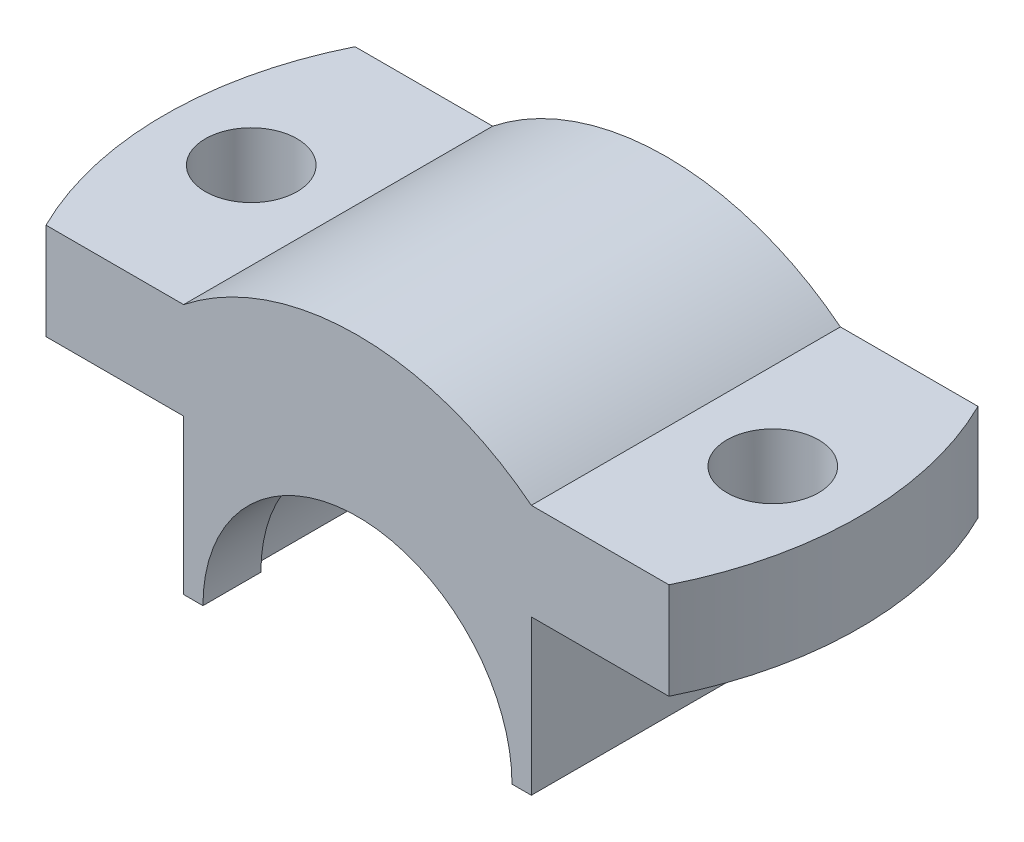
ISO-10303-21;
HEADER;
FILE_DESCRIPTION(('STEP AP214'),'2;1');
FILE_NAME('part.step','',(''),(''),'','','');
FILE_SCHEMA(('AUTOMOTIVE_DESIGN { 1 0 10303 214 1 1 1 1 }'));
ENDSEC;
DATA;
#1=APPLICATION_CONTEXT('core data for automotive mechanical design processes');
#2=APPLICATION_PROTOCOL_DEFINITION('international standard','automotive_design',2000,#1);
#3=PRODUCT_CONTEXT('',#1,'mechanical');
#4=PRODUCT('Part','Part','',(#3));
#5=PRODUCT_RELATED_PRODUCT_CATEGORY('part','',(#4));
#6=PRODUCT_DEFINITION_FORMATION('','',#4);
#7=PRODUCT_DEFINITION_CONTEXT('part definition',#1,'design');
#8=PRODUCT_DEFINITION('design','',#6,#7);
#9=PRODUCT_DEFINITION_SHAPE('','',#8);
#10=(LENGTH_UNIT() NAMED_UNIT(*) SI_UNIT(.MILLI.,.METRE.));
#11=(NAMED_UNIT(*) PLANE_ANGLE_UNIT() SI_UNIT($,.RADIAN.));
#12=(NAMED_UNIT(*) SI_UNIT($,.STERADIAN.) SOLID_ANGLE_UNIT());
#13=UNCERTAINTY_MEASURE_WITH_UNIT(LENGTH_MEASURE(1.E-05),#10,'distance_accuracy_value','');
#14=(GEOMETRIC_REPRESENTATION_CONTEXT(3) GLOBAL_UNCERTAINTY_ASSIGNED_CONTEXT((#13)) GLOBAL_UNIT_ASSIGNED_CONTEXT((#10,
#11,#12)) REPRESENTATION_CONTEXT('',''));
#15=CARTESIAN_POINT('',(0.,0.,0.));
#16=DIRECTION('',(0.,0.,1.));
#17=DIRECTION('',(1.,0.,0.));
#18=AXIS2_PLACEMENT_3D('',#15,#16,#17);
#19=CARTESIAN_POINT('',(0.,0.,32.));
#20=DIRECTION('',(0.,0.,-1.));
#21=DIRECTION('',(-1.,0.,0.));
#22=AXIS2_PLACEMENT_3D('',#19,#20,#21);
#23=CYLINDRICAL_SURFACE('',#22,32.);
#24=DIRECTION('',(0.,0.,-1.));
#25=VECTOR('',#24,1.);
#26=CARTESIAN_POINT('',(-32.,0.,32.));
#27=LINE('',#26,#25);
#28=CARTESIAN_POINT('',(-32.,0.,32.));
#29=VERTEX_POINT('',#28);
#30=CARTESIAN_POINT('',(-32.,0.,20.));
#31=VERTEX_POINT('',#30);
#32=EDGE_CURVE('E204',#29,#31,#27,.T.);
#33=ORIENTED_EDGE('',*,*,#32,.T.);
#34=CARTESIAN_POINT('',(0.,0.,20.));
#35=DIRECTION('',(0.,0.,-1.));
#36=DIRECTION('',(-1.,0.,0.));
#37=AXIS2_PLACEMENT_3D('',#34,#35,#36);
#38=CIRCLE('',#37,32.);
#39=CARTESIAN_POINT('',(32.,0.,20.));
#40=VERTEX_POINT('',#39);
#41=EDGE_CURVE('E165',#31,#40,#38,.T.);
#42=ORIENTED_EDGE('',*,*,#41,.T.);
#43=DIRECTION('',(0.,0.,-1.));
#44=VECTOR('',#43,1.);
#45=CARTESIAN_POINT('',(32.,0.,32.));
#46=LINE('',#45,#44);
#47=CARTESIAN_POINT('',(32.,0.,32.));
#48=VERTEX_POINT('',#47);
#49=EDGE_CURVE('E177',#48,#40,#46,.T.);
#50=ORIENTED_EDGE('',*,*,#49,.F.);
#51=CARTESIAN_POINT('',(0.,0.,32.));
#52=DIRECTION('',(0.,0.,-1.));
#53=DIRECTION('',(1.,0.,0.));
#54=AXIS2_PLACEMENT_3D('',#51,#52,#53);
#55=CIRCLE('',#54,32.);
#56=EDGE_CURVE('E210',#29,#48,#55,.T.);
#57=ORIENTED_EDGE('',*,*,#56,.F.);
#58=EDGE_LOOP('',(#33,#42,#50,#57));
#59=FACE_BOUND('',#58,.T.);
#60=ADVANCED_FACE('F32',(#59),#23,.F.);
#61=CARTESIAN_POINT('',(32.,0.,32.));
#62=DIRECTION('',(0.,1.,0.));
#63=DIRECTION('',(0.,0.,1.));
#64=AXIS2_PLACEMENT_3D('',#61,#62,#63);
#65=PLANE('',#64);
#66=ORIENTED_EDGE('',*,*,#49,.T.);
#67=DIRECTION('',(0.707106781186548,0.,-0.707106781186547));
#68=VECTOR('',#67,1.);
#69=CARTESIAN_POINT('',(0.,0.,52.));
#70=LINE('',#69,#68);
#71=CARTESIAN_POINT('',(34.,0.,18.));
#72=VERTEX_POINT('',#71);
#73=EDGE_CURVE('E166',#40,#72,#70,.T.);
#74=ORIENTED_EDGE('',*,*,#73,.T.);
#75=DIRECTION('',(0.,0.,-1.));
#76=VECTOR('',#75,1.);
#77=CARTESIAN_POINT('',(34.,0.,18.));
#78=LINE('',#77,#76);
#79=CARTESIAN_POINT('',(34.,0.,-20.));
#80=VERTEX_POINT('',#79);
#81=EDGE_CURVE('E150',#72,#80,#78,.T.);
#82=ORIENTED_EDGE('',*,*,#81,.T.);
#83=DIRECTION('',(-0.707106781186545,0.,-0.70710678118655));
#84=VECTOR('',#83,1.);
#85=CARTESIAN_POINT('',(0.,0.,-54.0000000000002));
#86=LINE('',#85,#84);
#87=CARTESIAN_POINT('',(32.,0.,-22.));
#88=VERTEX_POINT('',#87);
#89=EDGE_CURVE('E53',#80,#88,#86,.T.);
#90=ORIENTED_EDGE('',*,*,#89,.T.);
#91=CARTESIAN_POINT('',(32.,0.,-32.));
#92=VERTEX_POINT('',#91);
#93=EDGE_CURVE('E185',#88,#92,#46,.T.);
#94=ORIENTED_EDGE('',*,*,#93,.T.);
#95=DIRECTION('',(1.,0.,0.));
#96=VECTOR('',#95,1.);
#97=CARTESIAN_POINT('',(32.,0.,-32.));
#98=LINE('',#97,#96);
#99=CARTESIAN_POINT('',(36.,0.,-32.));
#100=VERTEX_POINT('',#99);
#101=EDGE_CURVE('E227',#92,#100,#98,.T.);
#102=ORIENTED_EDGE('',*,*,#101,.T.);
#103=DIRECTION('',(0.,0.,-1.));
#104=VECTOR('',#103,1.);
#105=CARTESIAN_POINT('',(36.,0.,32.));
#106=LINE('',#105,#104);
#107=CARTESIAN_POINT('',(36.,0.,32.));
#108=VERTEX_POINT('',#107);
#109=EDGE_CURVE('E186',#108,#100,#106,.T.);
#110=ORIENTED_EDGE('',*,*,#109,.F.);
#111=DIRECTION('',(1.,0.,0.));
#112=VECTOR('',#111,1.);
#113=CARTESIAN_POINT('',(32.,0.,32.));
#114=LINE('',#113,#112);
#115=EDGE_CURVE('E249',#48,#108,#114,.T.);
#116=ORIENTED_EDGE('',*,*,#115,.F.);
#117=EDGE_LOOP('',(#66,#74,#82,#90,#94,#102,#110,#116));
#118=FACE_BOUND('',#117,.T.);
#119=ADVANCED_FACE('F277',(#118),#65,.F.);
#120=CARTESIAN_POINT('',(-36.,0.,32.));
#121=DIRECTION('',(0.,1.,0.));
#122=DIRECTION('',(0.,0.,1.));
#123=AXIS2_PLACEMENT_3D('',#120,#121,#122);
#124=PLANE('',#123);
#125=DIRECTION('',(0.,0.,-1.));
#126=VECTOR('',#125,1.);
#127=CARTESIAN_POINT('',(-34.,0.,18.));
#128=LINE('',#127,#126);
#129=CARTESIAN_POINT('',(-34.,0.,18.));
#130=VERTEX_POINT('',#129);
#131=CARTESIAN_POINT('',(-34.,0.,-20.));
#132=VERTEX_POINT('',#131);
#133=EDGE_CURVE('E148',#130,#132,#128,.T.);
#134=ORIENTED_EDGE('',*,*,#133,.F.);
#135=DIRECTION('',(0.707106781186548,0.,0.707106781186547));
#136=VECTOR('',#135,1.);
#137=CARTESIAN_POINT('',(0.,0.,52.));
#138=LINE('',#137,#136);
#139=EDGE_CURVE('E40',#130,#31,#138,.T.);
#140=ORIENTED_EDGE('',*,*,#139,.T.);
#141=ORIENTED_EDGE('',*,*,#32,.F.);
#142=DIRECTION('',(1.,0.,0.));
#143=VECTOR('',#142,1.);
#144=CARTESIAN_POINT('',(-36.,0.,32.));
#145=LINE('',#144,#143);
#146=CARTESIAN_POINT('',(-36.,0.,32.));
#147=VERTEX_POINT('',#146);
#148=EDGE_CURVE('E231',#147,#29,#145,.T.);
#149=ORIENTED_EDGE('',*,*,#148,.F.);
#150=DIRECTION('',(0.,0.,-1.));
#151=VECTOR('',#150,1.);
#152=CARTESIAN_POINT('',(-36.,0.,32.));
#153=LINE('',#152,#151);
#154=CARTESIAN_POINT('',(-36.,0.,-32.));
#155=VERTEX_POINT('',#154);
#156=EDGE_CURVE('E201',#147,#155,#153,.T.);
#157=ORIENTED_EDGE('',*,*,#156,.T.);
#158=DIRECTION('',(1.,0.,0.));
#159=VECTOR('',#158,1.);
#160=CARTESIAN_POINT('',(-36.,0.,-32.));
#161=LINE('',#160,#159);
#162=CARTESIAN_POINT('',(-32.,0.,-32.));
#163=VERTEX_POINT('',#162);
#164=EDGE_CURVE('E207',#155,#163,#161,.T.);
#165=ORIENTED_EDGE('',*,*,#164,.T.);
#166=CARTESIAN_POINT('',(-32.,0.,-22.));
#167=VERTEX_POINT('',#166);
#168=EDGE_CURVE('E206',#167,#163,#27,.T.);
#169=ORIENTED_EDGE('',*,*,#168,.F.);
#170=DIRECTION('',(-0.707106781186545,0.,0.70710678118655));
#171=VECTOR('',#170,1.);
#172=CARTESIAN_POINT('',(0.,0.,-54.0000000000002));
#173=LINE('',#172,#171);
#174=EDGE_CURVE('E160',#167,#132,#173,.T.);
#175=ORIENTED_EDGE('',*,*,#174,.T.);
#176=EDGE_LOOP('',(#134,#140,#141,#149,#157,#165,#169,#175));
#177=FACE_BOUND('',#176,.T.);
#178=ADVANCED_FACE('F156',(#177),#124,.F.);
#179=CARTESIAN_POINT('',(36.,32.,32.));
#180=DIRECTION('',(0.,1.,0.));
#181=DIRECTION('',(0.,0.,1.));
#182=AXIS2_PLACEMENT_3D('',#179,#180,#181);
#183=PLANE('',#182);
#184=CARTESIAN_POINT('',(54.,32.,0.));
#185=DIRECTION('',(0.,1.,0.));
#186=DIRECTION('',(0.,0.,1.));
#187=AXIS2_PLACEMENT_3D('',#184,#185,#186);
#188=CIRCLE('',#187,9.5);
#189=CARTESIAN_POINT('',(54.,32.,9.5));
#190=VERTEX_POINT('',#189);
#191=EDGE_CURVE('E255',#190,#190,#188,.T.);
#192=ORIENTED_EDGE('',*,*,#191,.T.);
#193=EDGE_LOOP('',(#192));
#194=FACE_BOUND('',#193,.T.);
#195=CARTESIAN_POINT('',(0.,32.,0.));
#196=DIRECTION('',(0.,1.,0.));
#197=DIRECTION('',(0.,0.,1.));
#198=AXIS2_PLACEMENT_3D('',#195,#196,#197);
#199=CIRCLE('',#198,72.);
#200=CARTESIAN_POINT('',(64.4980619863884,32.,32.));
#201=VERTEX_POINT('',#200);
#202=CARTESIAN_POINT('',(64.4980619863884,32.,-32.));
#203=VERTEX_POINT('',#202);
#204=EDGE_CURVE('E265',#201,#203,#199,.T.);
#205=ORIENTED_EDGE('',*,*,#204,.F.);
#206=DIRECTION('',(1.,0.,0.));
#207=VECTOR('',#206,1.);
#208=CARTESIAN_POINT('',(36.,32.,32.));
#209=LINE('',#208,#207);
#210=CARTESIAN_POINT('',(36.,32.,32.));
#211=VERTEX_POINT('',#210);
#212=EDGE_CURVE('E244',#211,#201,#209,.T.);
#213=ORIENTED_EDGE('',*,*,#212,.F.);
#214=DIRECTION('',(0.,0.,-1.));
#215=VECTOR('',#214,1.);
#216=CARTESIAN_POINT('',(36.,32.,32.));
#217=LINE('',#216,#215);
#218=CARTESIAN_POINT('',(36.,32.,-32.));
#219=VERTEX_POINT('',#218);
#220=EDGE_CURVE('E189',#211,#219,#217,.T.);
#221=ORIENTED_EDGE('',*,*,#220,.T.);
#222=DIRECTION('',(1.,0.,0.));
#223=VECTOR('',#222,1.);
#224=CARTESIAN_POINT('',(36.,32.,-32.));
#225=LINE('',#224,#223);
#226=EDGE_CURVE('E222',#219,#203,#225,.T.);
#227=ORIENTED_EDGE('',*,*,#226,.T.);
#228=EDGE_LOOP('',(#205,#213,#221,#227));
#229=FACE_BOUND('',#228,.T.);
#230=ADVANCED_FACE('F333',(#194,#229),#183,.F.);
#231=CARTESIAN_POINT('',(72.,52.,32.));
#232=DIRECTION('',(0.,-1.,0.));
#233=DIRECTION('',(1.,0.,0.));
#234=AXIS2_PLACEMENT_3D('',#231,#232,#233);
#235=PLANE('',#234);
#236=CARTESIAN_POINT('',(54.,52.,0.));
#237=DIRECTION('',(0.,1.,0.));
#238=DIRECTION('',(0.,0.,-1.));
#239=AXIS2_PLACEMENT_3D('',#236,#237,#238);
#240=CIRCLE('',#239,9.5);
#241=CARTESIAN_POINT('',(54.,52.,-9.5));
#242=VERTEX_POINT('',#241);
#243=EDGE_CURVE('E258',#242,#242,#240,.T.);
#244=ORIENTED_EDGE('',*,*,#243,.F.);
#245=EDGE_LOOP('',(#244));
#246=FACE_BOUND('',#245,.T.);
#247=DIRECTION('',(-1.,0.,0.));
#248=VECTOR('',#247,1.);
#249=CARTESIAN_POINT('',(72.,52.,32.));
#250=LINE('',#249,#248);
#251=CARTESIAN_POINT('',(64.4980619863884,52.,32.));
#252=VERTEX_POINT('',#251);
#253=CARTESIAN_POINT('',(36.,52.,32.));
#254=VERTEX_POINT('',#253);
#255=EDGE_CURVE('E242',#252,#254,#250,.T.);
#256=ORIENTED_EDGE('',*,*,#255,.F.);
#257=CARTESIAN_POINT('',(0.,52.,0.));
#258=DIRECTION('',(0.,1.,0.));
#259=DIRECTION('',(-1.,0.,0.));
#260=AXIS2_PLACEMENT_3D('',#257,#258,#259);
#261=CIRCLE('',#260,72.);
#262=CARTESIAN_POINT('',(64.4980619863884,52.,-32.));
#263=VERTEX_POINT('',#262);
#264=EDGE_CURVE('E269',#252,#263,#261,.T.);
#265=ORIENTED_EDGE('',*,*,#264,.T.);
#266=DIRECTION('',(-1.,0.,0.));
#267=VECTOR('',#266,1.);
#268=CARTESIAN_POINT('',(72.,52.,-32.));
#269=LINE('',#268,#267);
#270=CARTESIAN_POINT('',(36.,52.,-32.));
#271=VERTEX_POINT('',#270);
#272=EDGE_CURVE('E220',#263,#271,#269,.T.);
#273=ORIENTED_EDGE('',*,*,#272,.T.);
#274=DIRECTION('',(0.,0.,-1.));
#275=VECTOR('',#274,1.);
#276=CARTESIAN_POINT('',(36.,52.,32.));
#277=LINE('',#276,#275);
#278=EDGE_CURVE('E192',#254,#271,#277,.T.);
#279=ORIENTED_EDGE('',*,*,#278,.F.);
#280=EDGE_LOOP('',(#256,#265,#273,#279));
#281=FACE_BOUND('',#280,.T.);
#282=ADVANCED_FACE('F339',(#246,#281),#235,.F.);
#283=CARTESIAN_POINT('',(0.,0.,32.));
#284=DIRECTION('',(0.,0.,1.));
#285=DIRECTION('',(1.,0.,0.));
#286=AXIS2_PLACEMENT_3D('',#283,#284,#285);
#287=PLANE('',#286);
#288=ORIENTED_EDGE('',*,*,#212,.T.);
#289=DIRECTION('',(0.,1.,0.));
#290=VECTOR('',#289,1.);
#291=CARTESIAN_POINT('',(64.4980619863884,30.,32.));
#292=LINE('',#291,#290);
#293=EDGE_CURVE('E272',#201,#252,#292,.T.);
#294=ORIENTED_EDGE('',*,*,#293,.T.);
#295=ORIENTED_EDGE('',*,*,#255,.T.);
#296=CARTESIAN_POINT('',(0.,6.5247319963917,32.));
#297=DIRECTION('',(0.,0.,1.));
#298=DIRECTION('',(-1.,0.,0.));
#299=AXIS2_PLACEMENT_3D('',#296,#297,#298);
#300=CIRCLE('',#299,58.);
#301=CARTESIAN_POINT('',(-36.,52.,32.));
#302=VERTEX_POINT('',#301);
#303=EDGE_CURVE('E240',#254,#302,#300,.T.);
#304=ORIENTED_EDGE('',*,*,#303,.T.);
#305=DIRECTION('',(-1.,0.,0.));
#306=VECTOR('',#305,1.);
#307=CARTESIAN_POINT('',(-72.,52.,32.));
#308=LINE('',#307,#306);
#309=CARTESIAN_POINT('',(-64.4980619863884,52.,32.));
#310=VERTEX_POINT('',#309);
#311=EDGE_CURVE('E237',#302,#310,#308,.T.);
#312=ORIENTED_EDGE('',*,*,#311,.T.);
#313=DIRECTION('',(0.,1.,0.));
#314=VECTOR('',#313,1.);
#315=CARTESIAN_POINT('',(-64.4980619863884,30.,32.));
#316=LINE('',#315,#314);
#317=CARTESIAN_POINT('',(-64.4980619863884,32.,32.));
#318=VERTEX_POINT('',#317);
#319=EDGE_CURVE('E172',#310,#318,#316,.F.);
#320=ORIENTED_EDGE('',*,*,#319,.T.);
#321=DIRECTION('',(1.,0.,0.));
#322=VECTOR('',#321,1.);
#323=CARTESIAN_POINT('',(-36.,32.,32.));
#324=LINE('',#323,#322);
#325=CARTESIAN_POINT('',(-36.,32.,32.));
#326=VERTEX_POINT('',#325);
#327=EDGE_CURVE('E235',#318,#326,#324,.T.);
#328=ORIENTED_EDGE('',*,*,#327,.T.);
#329=DIRECTION('',(0.,-1.,0.));
#330=VECTOR('',#329,1.);
#331=CARTESIAN_POINT('',(-36.,32.,32.));
#332=LINE('',#331,#330);
#333=EDGE_CURVE('E233',#326,#147,#332,.T.);
#334=ORIENTED_EDGE('',*,*,#333,.T.);
#335=ORIENTED_EDGE('',*,*,#148,.T.);
#336=ORIENTED_EDGE('',*,*,#56,.T.);
#337=ORIENTED_EDGE('',*,*,#115,.T.);
#338=DIRECTION('',(0.,1.,0.));
#339=VECTOR('',#338,1.);
#340=CARTESIAN_POINT('',(36.,0.,32.));
#341=LINE('',#340,#339);
#342=EDGE_CURVE('E247',#108,#211,#341,.T.);
#343=ORIENTED_EDGE('',*,*,#342,.T.);
#344=EDGE_LOOP('',(#288,#294,#295,#304,#312,#320,#328,#334,#335,#336,#337,#343));
#345=FACE_BOUND('',#344,.T.);
#346=ADVANCED_FACE('F285',(#345),#287,.T.);
#347=CARTESIAN_POINT('',(0.,0.,-32.));
#348=DIRECTION('',(0.,0.,1.));
#349=DIRECTION('',(1.,0.,0.));
#350=AXIS2_PLACEMENT_3D('',#347,#348,#349);
#351=PLANE('',#350);
#352=DIRECTION('',(0.,1.,0.));
#353=VECTOR('',#352,1.);
#354=CARTESIAN_POINT('',(64.4980619863884,30.,-32.));
#355=LINE('',#354,#353);
#356=EDGE_CURVE('E267',#203,#263,#355,.T.);
#357=ORIENTED_EDGE('',*,*,#356,.F.);
#358=ORIENTED_EDGE('',*,*,#226,.F.);
#359=DIRECTION('',(0.,1.,0.));
#360=VECTOR('',#359,1.);
#361=CARTESIAN_POINT('',(36.,0.,-32.));
#362=LINE('',#361,#360);
#363=EDGE_CURVE('E225',#100,#219,#362,.T.);
#364=ORIENTED_EDGE('',*,*,#363,.F.);
#365=ORIENTED_EDGE('',*,*,#101,.F.);
#366=CARTESIAN_POINT('',(0.,0.,-32.));
#367=DIRECTION('',(0.,0.,-1.));
#368=DIRECTION('',(1.,0.,0.));
#369=AXIS2_PLACEMENT_3D('',#366,#367,#368);
#370=CIRCLE('',#369,32.);
#371=EDGE_CURVE('E181',#163,#92,#370,.T.);
#372=ORIENTED_EDGE('',*,*,#371,.F.);
#373=ORIENTED_EDGE('',*,*,#164,.F.);
#374=DIRECTION('',(0.,-1.,0.));
#375=VECTOR('',#374,1.);
#376=CARTESIAN_POINT('',(-36.,32.,-32.));
#377=LINE('',#376,#375);
#378=CARTESIAN_POINT('',(-36.,32.,-32.));
#379=VERTEX_POINT('',#378);
#380=EDGE_CURVE('E211',#379,#155,#377,.T.);
#381=ORIENTED_EDGE('',*,*,#380,.F.);
#382=DIRECTION('',(1.,0.,0.));
#383=VECTOR('',#382,1.);
#384=CARTESIAN_POINT('',(-36.,32.,-32.));
#385=LINE('',#384,#383);
#386=CARTESIAN_POINT('',(-64.4980619863884,32.,-32.));
#387=VERTEX_POINT('',#386);
#388=EDGE_CURVE('E213',#387,#379,#385,.T.);
#389=ORIENTED_EDGE('',*,*,#388,.F.);
#390=DIRECTION('',(0.,1.,0.));
#391=VECTOR('',#390,1.);
#392=CARTESIAN_POINT('',(-64.4980619863884,30.,-32.));
#393=LINE('',#392,#391);
#394=CARTESIAN_POINT('',(-64.4980619863884,52.,-32.));
#395=VERTEX_POINT('',#394);
#396=EDGE_CURVE('E175',#395,#387,#393,.F.);
#397=ORIENTED_EDGE('',*,*,#396,.F.);
#398=DIRECTION('',(-1.,0.,0.));
#399=VECTOR('',#398,1.);
#400=CARTESIAN_POINT('',(-72.,52.,-32.));
#401=LINE('',#400,#399);
#402=CARTESIAN_POINT('',(-36.,52.,-32.));
#403=VERTEX_POINT('',#402);
#404=EDGE_CURVE('E215',#403,#395,#401,.T.);
#405=ORIENTED_EDGE('',*,*,#404,.F.);
#406=CARTESIAN_POINT('',(0.,6.5247319963917,-32.));
#407=DIRECTION('',(0.,0.,1.));
#408=DIRECTION('',(-1.,0.,0.));
#409=AXIS2_PLACEMENT_3D('',#406,#407,#408);
#410=CIRCLE('',#409,58.);
#411=EDGE_CURVE('E218',#271,#403,#410,.T.);
#412=ORIENTED_EDGE('',*,*,#411,.F.);
#413=ORIENTED_EDGE('',*,*,#272,.F.);
#414=EDGE_LOOP('',(#357,#358,#364,#365,#372,#373,#381,#389,#397,#405,#412,#413));
#415=FACE_BOUND('',#414,.T.);
#416=ADVANCED_FACE('F295',(#415),#351,.F.);
#417=CARTESIAN_POINT('',(-72.,52.,32.));
#418=DIRECTION('',(0.,-1.,0.));
#419=DIRECTION('',(0.,0.,-1.));
#420=AXIS2_PLACEMENT_3D('',#417,#418,#419);
#421=PLANE('',#420);
#422=CARTESIAN_POINT('',(-54.,52.,0.));
#423=DIRECTION('',(0.,1.,0.));
#424=DIRECTION('',(0.,0.,1.));
#425=AXIS2_PLACEMENT_3D('',#422,#423,#424);
#426=CIRCLE('',#425,9.5);
#427=CARTESIAN_POINT('',(-54.,52.,9.5));
#428=VERTEX_POINT('',#427);
#429=EDGE_CURVE('E182',#428,#428,#426,.T.);
#430=ORIENTED_EDGE('',*,*,#429,.F.);
#431=EDGE_LOOP('',(#430));
#432=FACE_BOUND('',#431,.T.);
#433=CARTESIAN_POINT('',(0.,52.,0.));
#434=DIRECTION('',(0.,1.,0.));
#435=DIRECTION('',(-1.,0.,0.));
#436=AXIS2_PLACEMENT_3D('',#433,#434,#435);
#437=CIRCLE('',#436,72.);
#438=EDGE_CURVE('E263',#395,#310,#437,.T.);
#439=ORIENTED_EDGE('',*,*,#438,.T.);
#440=ORIENTED_EDGE('',*,*,#311,.F.);
#441=DIRECTION('',(0.,0.,-1.));
#442=VECTOR('',#441,1.);
#443=CARTESIAN_POINT('',(-36.,52.,32.));
#444=LINE('',#443,#442);
#445=EDGE_CURVE('E195',#302,#403,#444,.T.);
#446=ORIENTED_EDGE('',*,*,#445,.T.);
#447=ORIENTED_EDGE('',*,*,#404,.T.);
#448=EDGE_LOOP('',(#439,#440,#446,#447));
#449=FACE_BOUND('',#448,.T.);
#450=ADVANCED_FACE('F323',(#432,#449),#421,.F.);
#451=CARTESIAN_POINT('',(-36.,32.,32.));
#452=DIRECTION('',(0.,1.,0.));
#453=DIRECTION('',(0.,0.,1.));
#454=AXIS2_PLACEMENT_3D('',#451,#452,#453);
#455=PLANE('',#454);
#456=CARTESIAN_POINT('',(-54.,32.,0.));
#457=DIRECTION('',(0.,1.,0.));
#458=DIRECTION('',(0.,0.,1.));
#459=AXIS2_PLACEMENT_3D('',#456,#457,#458);
#460=CIRCLE('',#459,9.5);
#461=CARTESIAN_POINT('',(-54.,32.,9.5));
#462=VERTEX_POINT('',#461);
#463=EDGE_CURVE('E178',#462,#462,#460,.T.);
#464=ORIENTED_EDGE('',*,*,#463,.T.);
#465=EDGE_LOOP('',(#464));
#466=FACE_BOUND('',#465,.T.);
#467=ORIENTED_EDGE('',*,*,#327,.F.);
#468=CARTESIAN_POINT('',(0.,32.,0.));
#469=DIRECTION('',(0.,1.,0.));
#470=DIRECTION('',(0.,0.,1.));
#471=AXIS2_PLACEMENT_3D('',#468,#469,#470);
#472=CIRCLE('',#471,72.);
#473=EDGE_CURVE('E261',#387,#318,#472,.T.);
#474=ORIENTED_EDGE('',*,*,#473,.F.);
#475=ORIENTED_EDGE('',*,*,#388,.T.);
#476=DIRECTION('',(0.,0.,-1.));
#477=VECTOR('',#476,1.);
#478=CARTESIAN_POINT('',(-36.,32.,32.));
#479=LINE('',#478,#477);
#480=EDGE_CURVE('E198',#326,#379,#479,.T.);
#481=ORIENTED_EDGE('',*,*,#480,.F.);
#482=EDGE_LOOP('',(#467,#474,#475,#481));
#483=FACE_BOUND('',#482,.T.);
#484=ADVANCED_FACE('F313',(#466,#483),#455,.F.);
#485=ORIENTED_EDGE('',*,*,#93,.F.);
#486=CARTESIAN_POINT('',(0.,0.,-22.));
#487=DIRECTION('',(0.,0.,-1.));
#488=DIRECTION('',(-1.,0.,0.));
#489=AXIS2_PLACEMENT_3D('',#486,#487,#488);
#490=CIRCLE('',#489,32.);
#491=EDGE_CURVE('E11',#88,#167,#490,.F.);
#492=ORIENTED_EDGE('',*,*,#491,.T.);
#493=ORIENTED_EDGE('',*,*,#168,.T.);
#494=ORIENTED_EDGE('',*,*,#371,.T.);
#495=EDGE_LOOP('',(#485,#492,#493,#494));
#496=FACE_BOUND('',#495,.T.);
#497=ADVANCED_FACE('F305',(#496),#23,.F.);
#498=CARTESIAN_POINT('',(36.,0.,32.));
#499=DIRECTION('',(-1.,0.,0.));
#500=DIRECTION('',(0.,0.,1.));
#501=AXIS2_PLACEMENT_3D('',#498,#499,#500);
#502=PLANE('',#501);
#503=ORIENTED_EDGE('',*,*,#363,.T.);
#504=ORIENTED_EDGE('',*,*,#220,.F.);
#505=ORIENTED_EDGE('',*,*,#342,.F.);
#506=ORIENTED_EDGE('',*,*,#109,.T.);
#507=EDGE_LOOP('',(#503,#504,#505,#506));
#508=FACE_BOUND('',#507,.T.);
#509=ADVANCED_FACE('F312',(#508),#502,.F.);
#510=CARTESIAN_POINT('',(0.,6.5247319963917,32.));
#511=DIRECTION('',(0.,0.,-1.));
#512=DIRECTION('',(-1.,0.,0.));
#513=AXIS2_PLACEMENT_3D('',#510,#511,#512);
#514=CYLINDRICAL_SURFACE('',#513,58.);
#515=ORIENTED_EDGE('',*,*,#411,.T.);
#516=ORIENTED_EDGE('',*,*,#445,.F.);
#517=ORIENTED_EDGE('',*,*,#303,.F.);
#518=ORIENTED_EDGE('',*,*,#278,.T.);
#519=EDGE_LOOP('',(#515,#516,#517,#518));
#520=FACE_BOUND('',#519,.T.);
#521=ADVANCED_FACE('F319',(#520),#514,.T.);
#522=CARTESIAN_POINT('',(-36.,32.,32.));
#523=DIRECTION('',(1.,0.,0.));
#524=DIRECTION('',(0.,0.,-1.));
#525=AXIS2_PLACEMENT_3D('',#522,#523,#524);
#526=PLANE('',#525);
#527=ORIENTED_EDGE('',*,*,#380,.T.);
#528=ORIENTED_EDGE('',*,*,#156,.F.);
#529=ORIENTED_EDGE('',*,*,#333,.F.);
#530=ORIENTED_EDGE('',*,*,#480,.T.);
#531=EDGE_LOOP('',(#527,#528,#529,#530));
#532=FACE_BOUND('',#531,.T.);
#533=ADVANCED_FACE('F290',(#532),#526,.F.);
#534=CARTESIAN_POINT('',(-54.,-12.,0.));
#535=DIRECTION('',(0.,1.,0.));
#536=DIRECTION('',(0.,0.,1.));
#537=AXIS2_PLACEMENT_3D('',#534,#535,#536);
#538=CYLINDRICAL_SURFACE('',#537,9.5);
#539=ORIENTED_EDGE('',*,*,#429,.T.);
#540=EDGE_LOOP('',(#539));
#541=FACE_BOUND('',#540,.T.);
#542=ORIENTED_EDGE('',*,*,#463,.F.);
#543=EDGE_LOOP('',(#542));
#544=FACE_BOUND('',#543,.T.);
#545=ADVANCED_FACE('F366',(#541,#544),#538,.F.);
#546=CARTESIAN_POINT('',(54.,-12.,0.));
#547=DIRECTION('',(0.,1.,0.));
#548=DIRECTION('',(0.,0.,1.));
#549=AXIS2_PLACEMENT_3D('',#546,#547,#548);
#550=CYLINDRICAL_SURFACE('',#549,9.5);
#551=ORIENTED_EDGE('',*,*,#243,.T.);
#552=EDGE_LOOP('',(#551));
#553=FACE_BOUND('',#552,.T.);
#554=ORIENTED_EDGE('',*,*,#191,.F.);
#555=EDGE_LOOP('',(#554));
#556=FACE_BOUND('',#555,.T.);
#557=ADVANCED_FACE('F361',(#553,#556),#550,.F.);
#558=CARTESIAN_POINT('',(0.,30.,0.));
#559=DIRECTION('',(0.,1.,0.));
#560=DIRECTION('',(-1.,0.,0.));
#561=AXIS2_PLACEMENT_3D('',#558,#559,#560);
#562=CYLINDRICAL_SURFACE('',#561,72.);
#563=ORIENTED_EDGE('',*,*,#473,.T.);
#564=ORIENTED_EDGE('',*,*,#319,.F.);
#565=ORIENTED_EDGE('',*,*,#438,.F.);
#566=ORIENTED_EDGE('',*,*,#396,.T.);
#567=EDGE_LOOP('',(#563,#564,#565,#566));
#568=FACE_BOUND('',#567,.T.);
#569=ADVANCED_FACE('F350',(#568),#562,.T.);
#570=CARTESIAN_POINT('',(0.,30.,0.));
#571=DIRECTION('',(0.,1.,0.));
#572=DIRECTION('',(-1.,0.,0.));
#573=AXIS2_PLACEMENT_3D('',#570,#571,#572);
#574=CYLINDRICAL_SURFACE('',#573,72.);
#575=ORIENTED_EDGE('',*,*,#204,.T.);
#576=ORIENTED_EDGE('',*,*,#356,.T.);
#577=ORIENTED_EDGE('',*,*,#264,.F.);
#578=ORIENTED_EDGE('',*,*,#293,.F.);
#579=EDGE_LOOP('',(#575,#576,#577,#578));
#580=FACE_BOUND('',#579,.T.);
#581=ADVANCED_FACE('F353',(#580),#574,.T.);
#582=CARTESIAN_POINT('',(0.,0.,18.));
#583=DIRECTION('',(0.,0.,-1.));
#584=DIRECTION('',(-1.,0.,0.));
#585=AXIS2_PLACEMENT_3D('',#582,#583,#584);
#586=CYLINDRICAL_SURFACE('',#585,34.);
#587=CARTESIAN_POINT('',(0.,0.,-20.));
#588=DIRECTION('',(0.,0.,-1.));
#589=DIRECTION('',(-1.,0.,0.));
#590=AXIS2_PLACEMENT_3D('',#587,#588,#589);
#591=CIRCLE('',#590,34.);
#592=EDGE_CURVE('E153',#132,#80,#591,.T.);
#593=ORIENTED_EDGE('',*,*,#592,.T.);
#594=ORIENTED_EDGE('',*,*,#81,.F.);
#595=CARTESIAN_POINT('',(0.,0.,18.));
#596=DIRECTION('',(0.,0.,-1.));
#597=DIRECTION('',(-1.,0.,0.));
#598=AXIS2_PLACEMENT_3D('',#595,#596,#597);
#599=CIRCLE('',#598,34.);
#600=EDGE_CURVE('E144',#130,#72,#599,.T.);
#601=ORIENTED_EDGE('',*,*,#600,.F.);
#602=ORIENTED_EDGE('',*,*,#133,.T.);
#603=EDGE_LOOP('',(#593,#594,#601,#602));
#604=FACE_BOUND('',#603,.T.);
#605=ADVANCED_FACE('F147',(#604),#586,.F.);
#606=CARTESIAN_POINT('',(0.,0.,20.));
#607=DIRECTION('',(0.,0.,-1.));
#608=DIRECTION('',(-1.,0.,0.));
#609=AXIS2_PLACEMENT_3D('',#606,#607,#608);
#610=CONICAL_SURFACE('',#609,32.,0.785398163397448);
#611=ORIENTED_EDGE('',*,*,#139,.F.);
#612=ORIENTED_EDGE('',*,*,#600,.T.);
#613=ORIENTED_EDGE('',*,*,#73,.F.);
#614=ORIENTED_EDGE('',*,*,#41,.F.);
#615=EDGE_LOOP('',(#611,#612,#613,#614));
#616=FACE_BOUND('',#615,.T.);
#617=ADVANCED_FACE('F163',(#616),#610,.F.);
#618=CARTESIAN_POINT('',(0.,0.,-20.));
#619=DIRECTION('',(0.,0.,1.));
#620=DIRECTION('',(1.,0.,0.));
#621=AXIS2_PLACEMENT_3D('',#618,#619,#620);
#622=CONICAL_SURFACE('',#621,34.,0.785398163397445);
#623=ORIENTED_EDGE('',*,*,#174,.F.);
#624=ORIENTED_EDGE('',*,*,#491,.F.);
#625=ORIENTED_EDGE('',*,*,#89,.F.);
#626=ORIENTED_EDGE('',*,*,#592,.F.);
#627=EDGE_LOOP('',(#623,#624,#625,#626));
#628=FACE_BOUND('',#627,.T.);
#629=ADVANCED_FACE('F34',(#628),#622,.F.);
#630=CLOSED_SHELL('',(#60,#119,#178,#230,#282,#346,#416,#450,#484,#497,#509,#521,#533,#545,#557,
#569,#581,#605,#617,#629));
#631=MANIFOLD_SOLID_BREP('B2',#630);
#632=ADVANCED_BREP_SHAPE_REPRESENTATION('',(#18,#631),#14);
#633=SHAPE_DEFINITION_REPRESENTATION(#9,#632);
ENDSEC;
END-ISO-10303-21;
